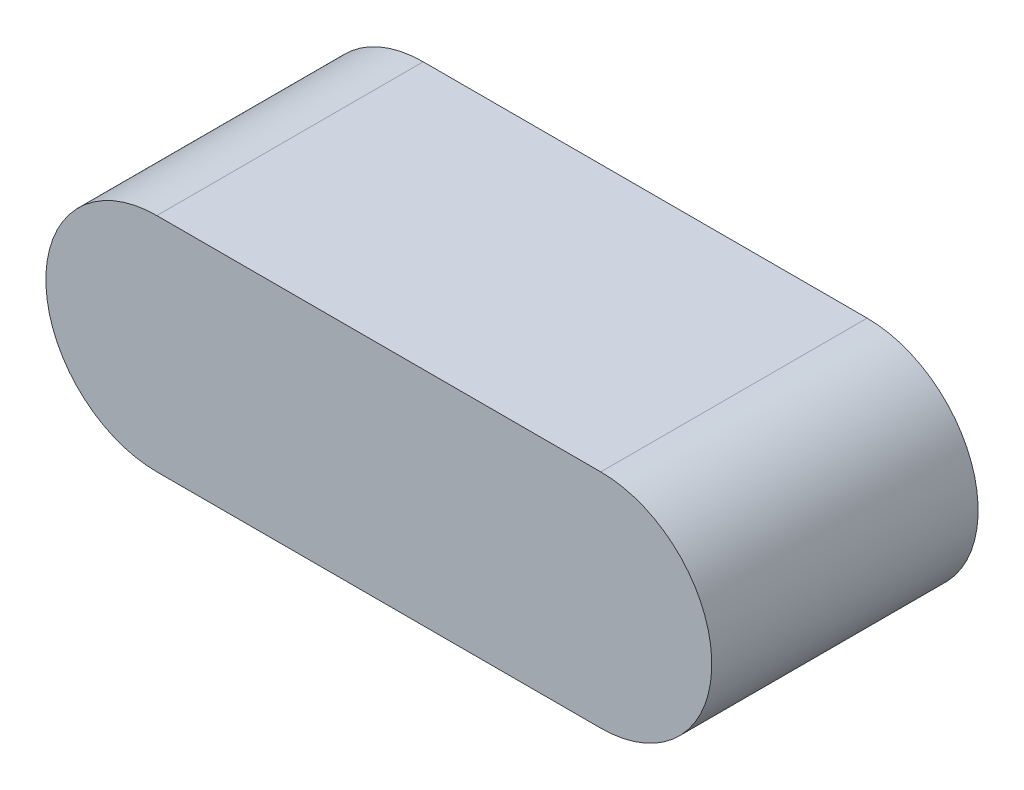
ISO-10303-21;
HEADER;
FILE_DESCRIPTION(('STEP AP214'),'2;1');
FILE_NAME('part.step','',(''),(''),'','','');
FILE_SCHEMA(('AUTOMOTIVE_DESIGN { 1 0 10303 214 1 1 1 1 }'));
ENDSEC;
DATA;
#1=APPLICATION_CONTEXT('core data for automotive mechanical design processes');
#2=APPLICATION_PROTOCOL_DEFINITION('international standard','automotive_design',2000,#1);
#3=PRODUCT_CONTEXT('',#1,'mechanical');
#4=PRODUCT('Part','Part','',(#3));
#5=PRODUCT_RELATED_PRODUCT_CATEGORY('part','',(#4));
#6=PRODUCT_DEFINITION_FORMATION('','',#4);
#7=PRODUCT_DEFINITION_CONTEXT('part definition',#1,'design');
#8=PRODUCT_DEFINITION('design','',#6,#7);
#9=PRODUCT_DEFINITION_SHAPE('','',#8);
#10=(LENGTH_UNIT() NAMED_UNIT(*) SI_UNIT(.MILLI.,.METRE.));
#11=(NAMED_UNIT(*) PLANE_ANGLE_UNIT() SI_UNIT($,.RADIAN.));
#12=(NAMED_UNIT(*) SI_UNIT($,.STERADIAN.) SOLID_ANGLE_UNIT());
#13=UNCERTAINTY_MEASURE_WITH_UNIT(LENGTH_MEASURE(1.E-05),#10,'distance_accuracy_value','');
#14=(GEOMETRIC_REPRESENTATION_CONTEXT(3) GLOBAL_UNCERTAINTY_ASSIGNED_CONTEXT((#13)) GLOBAL_UNIT_ASSIGNED_CONTEXT((#10,
#11,#12)) REPRESENTATION_CONTEXT('',''));
#15=CARTESIAN_POINT('',(0.,0.,0.));
#16=DIRECTION('',(0.,0.,1.));
#17=DIRECTION('',(1.,0.,0.));
#18=AXIS2_PLACEMENT_3D('',#15,#16,#17);
#19=CARTESIAN_POINT('',(-12.2600357142857,0.,6.));
#20=DIRECTION('',(0.,0.,-1.));
#21=DIRECTION('',(-1.,0.,0.));
#22=AXIS2_PLACEMENT_3D('',#19,#20,#21);
#23=CYLINDRICAL_SURFACE('',#22,2.5);
#24=CARTESIAN_POINT('',(-12.2600357142857,0.,0.));
#25=DIRECTION('',(0.,0.,1.));
#26=DIRECTION('',(1.,0.,0.));
#27=AXIS2_PLACEMENT_3D('',#24,#25,#26);
#28=CIRCLE('',#27,2.5);
#29=CARTESIAN_POINT('',(-12.2600357142857,2.5,0.));
#30=VERTEX_POINT('',#29);
#31=CARTESIAN_POINT('',(-12.2600357142857,-2.5,0.));
#32=VERTEX_POINT('',#31);
#33=EDGE_CURVE('E96',#30,#32,#28,.T.);
#34=ORIENTED_EDGE('',*,*,#33,.T.);
#35=DIRECTION('',(0.,0.,-1.));
#36=VECTOR('',#35,1.);
#37=CARTESIAN_POINT('',(-12.2600357142857,-2.5,6.));
#38=LINE('',#37,#36);
#39=CARTESIAN_POINT('',(-12.2600357142857,-2.5,6.));
#40=VERTEX_POINT('',#39);
#41=EDGE_CURVE('E11',#40,#32,#38,.T.);
#42=ORIENTED_EDGE('',*,*,#41,.F.);
#43=CARTESIAN_POINT('',(-12.2600357142857,0.,6.));
#44=DIRECTION('',(0.,0.,1.));
#45=DIRECTION('',(1.,0.,0.));
#46=AXIS2_PLACEMENT_3D('',#43,#44,#45);
#47=CIRCLE('',#46,2.5);
#48=CARTESIAN_POINT('',(-12.2600357142857,2.5,6.));
#49=VERTEX_POINT('',#48);
#50=EDGE_CURVE('E84',#49,#40,#47,.T.);
#51=ORIENTED_EDGE('',*,*,#50,.F.);
#52=DIRECTION('',(0.,0.,-1.));
#53=VECTOR('',#52,1.);
#54=CARTESIAN_POINT('',(-12.2600357142857,2.5,6.));
#55=LINE('',#54,#53);
#56=EDGE_CURVE('E92',#49,#30,#55,.T.);
#57=ORIENTED_EDGE('',*,*,#56,.T.);
#58=EDGE_LOOP('',(#34,#42,#51,#57));
#59=FACE_BOUND('',#58,.T.);
#60=ADVANCED_FACE('F33',(#59),#23,.T.);
#61=CARTESIAN_POINT('',(-12.2600357142857,-2.5,6.));
#62=DIRECTION('',(0.,1.,0.));
#63=DIRECTION('',(0.,0.,1.));
#64=AXIS2_PLACEMENT_3D('',#61,#62,#63);
#65=PLANE('',#64);
#66=DIRECTION('',(1.,0.,0.));
#67=VECTOR('',#66,1.);
#68=CARTESIAN_POINT('',(-12.2600357142857,-2.5,0.));
#69=LINE('',#68,#67);
#70=CARTESIAN_POINT('',(-2.26003571428569,-2.5,0.));
#71=VERTEX_POINT('',#70);
#72=EDGE_CURVE('E88',#32,#71,#69,.T.);
#73=ORIENTED_EDGE('',*,*,#72,.T.);
#74=DIRECTION('',(0.,0.,-1.));
#75=VECTOR('',#74,1.);
#76=CARTESIAN_POINT('',(-2.26003571428569,-2.5,6.));
#77=LINE('',#76,#75);
#78=CARTESIAN_POINT('',(-2.26003571428569,-2.5,6.));
#79=VERTEX_POINT('',#78);
#80=EDGE_CURVE('E41',#79,#71,#77,.T.);
#81=ORIENTED_EDGE('',*,*,#80,.F.);
#82=DIRECTION('',(1.,0.,0.));
#83=VECTOR('',#82,1.);
#84=CARTESIAN_POINT('',(-12.2600357142857,-2.5,6.));
#85=LINE('',#84,#83);
#86=EDGE_CURVE('E79',#40,#79,#85,.T.);
#87=ORIENTED_EDGE('',*,*,#86,.F.);
#88=ORIENTED_EDGE('',*,*,#41,.T.);
#89=EDGE_LOOP('',(#73,#81,#87,#88));
#90=FACE_BOUND('',#89,.T.);
#91=ADVANCED_FACE('F87',(#90),#65,.F.);
#92=CARTESIAN_POINT('',(-2.26003571428569,0.,6.));
#93=DIRECTION('',(0.,0.,-1.));
#94=DIRECTION('',(-1.,0.,0.));
#95=AXIS2_PLACEMENT_3D('',#92,#93,#94);
#96=CYLINDRICAL_SURFACE('',#95,2.5);
#97=CARTESIAN_POINT('',(-2.26003571428569,0.,0.));
#98=DIRECTION('',(0.,0.,1.));
#99=DIRECTION('',(1.,0.,0.));
#100=AXIS2_PLACEMENT_3D('',#97,#98,#99);
#101=CIRCLE('',#100,2.5);
#102=CARTESIAN_POINT('',(-2.26003571428569,2.5,0.));
#103=VERTEX_POINT('',#102);
#104=EDGE_CURVE('E66',#71,#103,#101,.T.);
#105=ORIENTED_EDGE('',*,*,#104,.T.);
#106=DIRECTION('',(0.,0.,-1.));
#107=VECTOR('',#106,1.);
#108=CARTESIAN_POINT('',(-2.26003571428569,2.5,6.));
#109=LINE('',#108,#107);
#110=CARTESIAN_POINT('',(-2.26003571428569,2.5,6.));
#111=VERTEX_POINT('',#110);
#112=EDGE_CURVE('E89',#111,#103,#109,.T.);
#113=ORIENTED_EDGE('',*,*,#112,.F.);
#114=CARTESIAN_POINT('',(-2.26003571428569,0.,6.));
#115=DIRECTION('',(0.,0.,1.));
#116=DIRECTION('',(1.,0.,0.));
#117=AXIS2_PLACEMENT_3D('',#114,#115,#116);
#118=CIRCLE('',#117,2.5);
#119=EDGE_CURVE('E82',#79,#111,#118,.T.);
#120=ORIENTED_EDGE('',*,*,#119,.F.);
#121=ORIENTED_EDGE('',*,*,#80,.T.);
#122=EDGE_LOOP('',(#105,#113,#120,#121));
#123=FACE_BOUND('',#122,.T.);
#124=ADVANCED_FACE('F90',(#123),#96,.T.);
#125=CARTESIAN_POINT('',(-12.2600357142857,2.5,6.));
#126=DIRECTION('',(0.,-1.,0.));
#127=DIRECTION('',(0.,0.,-1.));
#128=AXIS2_PLACEMENT_3D('',#125,#126,#127);
#129=PLANE('',#128);
#130=DIRECTION('',(-1.,0.,0.));
#131=VECTOR('',#130,1.);
#132=CARTESIAN_POINT('',(-12.2600357142857,2.5,0.));
#133=LINE('',#132,#131);
#134=EDGE_CURVE('E72',#103,#30,#133,.T.);
#135=ORIENTED_EDGE('',*,*,#134,.T.);
#136=ORIENTED_EDGE('',*,*,#56,.F.);
#137=DIRECTION('',(-1.,0.,0.));
#138=VECTOR('',#137,1.);
#139=CARTESIAN_POINT('',(-12.2600357142857,2.5,6.));
#140=LINE('',#139,#138);
#141=EDGE_CURVE('E49',#111,#49,#140,.T.);
#142=ORIENTED_EDGE('',*,*,#141,.F.);
#143=ORIENTED_EDGE('',*,*,#112,.T.);
#144=EDGE_LOOP('',(#135,#136,#142,#143));
#145=FACE_BOUND('',#144,.T.);
#146=ADVANCED_FACE('F103',(#145),#129,.F.);
#147=CARTESIAN_POINT('',(-12.2600357142857,0.,6.));
#148=DIRECTION('',(0.,0.,1.));
#149=DIRECTION('',(1.,0.,0.));
#150=AXIS2_PLACEMENT_3D('',#147,#148,#149);
#151=PLANE('',#150);
#152=ORIENTED_EDGE('',*,*,#50,.T.);
#153=ORIENTED_EDGE('',*,*,#86,.T.);
#154=ORIENTED_EDGE('',*,*,#119,.T.);
#155=ORIENTED_EDGE('',*,*,#141,.T.);
#156=EDGE_LOOP('',(#152,#153,#154,#155));
#157=FACE_BOUND('',#156,.T.);
#158=ADVANCED_FACE('F80',(#157),#151,.T.);
#159=CARTESIAN_POINT('',(-12.2600357142857,0.,0.));
#160=DIRECTION('',(0.,0.,1.));
#161=DIRECTION('',(1.,0.,0.));
#162=AXIS2_PLACEMENT_3D('',#159,#160,#161);
#163=PLANE('',#162);
#164=ORIENTED_EDGE('',*,*,#33,.F.);
#165=ORIENTED_EDGE('',*,*,#134,.F.);
#166=ORIENTED_EDGE('',*,*,#104,.F.);
#167=ORIENTED_EDGE('',*,*,#72,.F.);
#168=EDGE_LOOP('',(#164,#165,#166,#167));
#169=FACE_BOUND('',#168,.T.);
#170=ADVANCED_FACE('F106',(#169),#163,.F.);
#171=CLOSED_SHELL('',(#60,#91,#124,#146,#158,#170));
#172=MANIFOLD_SOLID_BREP('B2',#171);
#173=ADVANCED_BREP_SHAPE_REPRESENTATION('',(#18,#172),#14);
#174=SHAPE_DEFINITION_REPRESENTATION(#9,#173);
ENDSEC;
END-ISO-10303-21;
